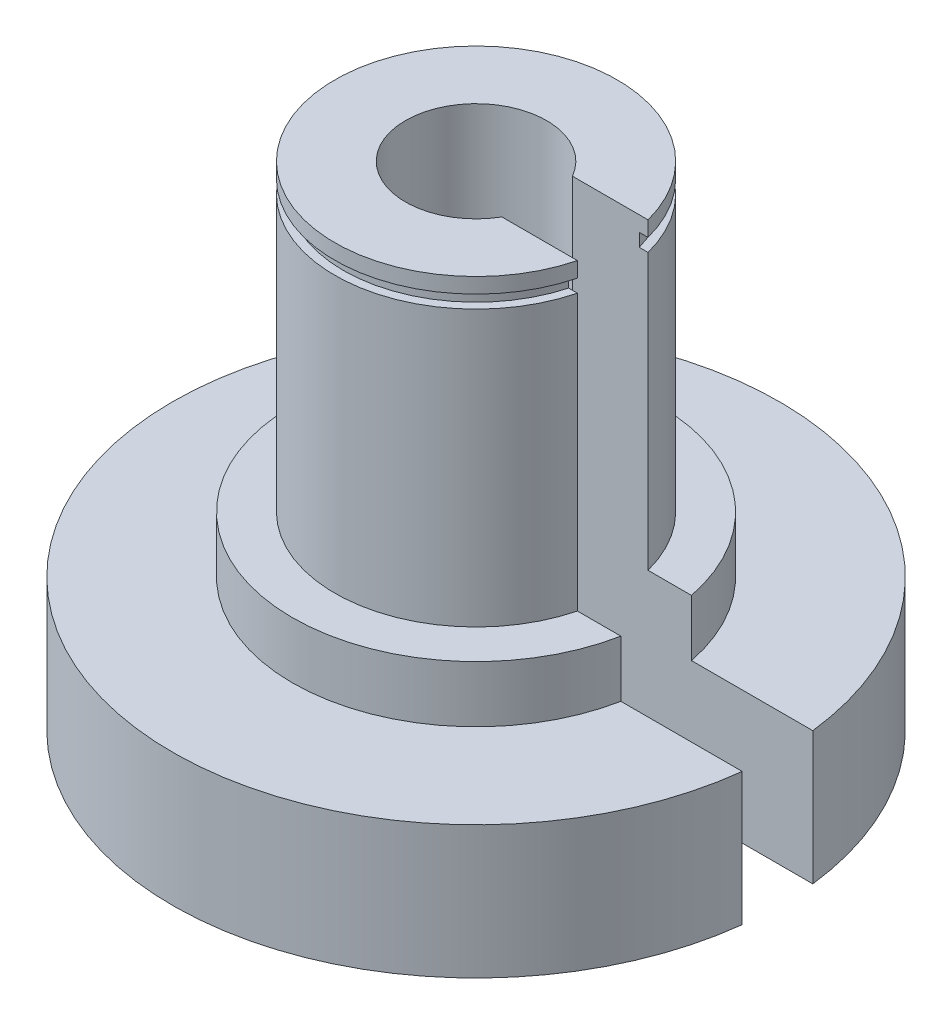
ISO-10303-21;
HEADER;
FILE_DESCRIPTION(('STEP AP214'),'2;1');
FILE_NAME('part.step','',(''),(''),'','','');
FILE_SCHEMA(('AUTOMOTIVE_DESIGN { 1 0 10303 214 1 1 1 1 }'));
ENDSEC;
DATA;
#1=APPLICATION_CONTEXT('core data for automotive mechanical design processes');
#2=APPLICATION_PROTOCOL_DEFINITION('international standard','automotive_design',2000,#1);
#3=PRODUCT_CONTEXT('',#1,'mechanical');
#4=PRODUCT('Part','Part','',(#3));
#5=PRODUCT_RELATED_PRODUCT_CATEGORY('part','',(#4));
#6=PRODUCT_DEFINITION_FORMATION('','',#4);
#7=PRODUCT_DEFINITION_CONTEXT('part definition',#1,'design');
#8=PRODUCT_DEFINITION('design','',#6,#7);
#9=PRODUCT_DEFINITION_SHAPE('','',#8);
#10=(LENGTH_UNIT() NAMED_UNIT(*) SI_UNIT(.MILLI.,.METRE.));
#11=(NAMED_UNIT(*) PLANE_ANGLE_UNIT() SI_UNIT($,.RADIAN.));
#12=(NAMED_UNIT(*) SI_UNIT($,.STERADIAN.) SOLID_ANGLE_UNIT());
#13=UNCERTAINTY_MEASURE_WITH_UNIT(LENGTH_MEASURE(1.E-05),#10,'distance_accuracy_value','');
#14=(GEOMETRIC_REPRESENTATION_CONTEXT(3) GLOBAL_UNCERTAINTY_ASSIGNED_CONTEXT((#13)) GLOBAL_UNIT_ASSIGNED_CONTEXT((#10,
#11,#12)) REPRESENTATION_CONTEXT('',''));
#15=CARTESIAN_POINT('',(0.,0.,0.));
#16=DIRECTION('',(0.,0.,1.));
#17=DIRECTION('',(1.,0.,0.));
#18=AXIS2_PLACEMENT_3D('',#15,#16,#17);
#19=CARTESIAN_POINT('',(0.,57.658,0.));
#20=DIRECTION('',(0.,-1.,0.));
#21=DIRECTION('',(0.,0.,-1.));
#22=AXIS2_PLACEMENT_3D('',#19,#20,#21);
#23=CYLINDRICAL_SURFACE('',#22,27.305);
#24=DIRECTION('',(0.,-1.,0.));
#25=VECTOR('',#24,1.);
#26=CARTESIAN_POINT('',(27.1197787601595,57.658,3.175));
#27=LINE('',#26,#25);
#28=CARTESIAN_POINT('',(27.1197787601595,0.,3.175));
#29=VERTEX_POINT('',#28);
#30=CARTESIAN_POINT('',(27.1197787601595,11.938,3.175));
#31=VERTEX_POINT('',#30);
#32=EDGE_CURVE('E179',#29,#31,#27,.F.);
#33=ORIENTED_EDGE('',*,*,#32,.T.);
#34=CARTESIAN_POINT('',(0.,11.938,0.));
#35=DIRECTION('',(0.,1.,0.));
#36=DIRECTION('',(0.,0.,1.));
#37=AXIS2_PLACEMENT_3D('',#34,#35,#36);
#38=CIRCLE('',#37,27.305);
#39=CARTESIAN_POINT('',(27.1197787601595,11.938,-3.175));
#40=VERTEX_POINT('',#39);
#41=EDGE_CURVE('E204',#40,#31,#38,.T.);
#42=ORIENTED_EDGE('',*,*,#41,.F.);
#43=DIRECTION('',(0.,-1.,0.));
#44=VECTOR('',#43,1.);
#45=CARTESIAN_POINT('',(27.1197787601595,57.658,-3.175));
#46=LINE('',#45,#44);
#47=CARTESIAN_POINT('',(27.1197787601595,0.,-3.175));
#48=VERTEX_POINT('',#47);
#49=EDGE_CURVE('E49',#40,#48,#46,.T.);
#50=ORIENTED_EDGE('',*,*,#49,.T.);
#51=CARTESIAN_POINT('',(0.,0.,0.));
#52=DIRECTION('',(0.,1.,0.));
#53=DIRECTION('',(0.,0.,1.));
#54=AXIS2_PLACEMENT_3D('',#51,#52,#53);
#55=CIRCLE('',#54,27.305);
#56=EDGE_CURVE('E186',#48,#29,#55,.T.);
#57=ORIENTED_EDGE('',*,*,#56,.T.);
#58=EDGE_LOOP('',(#33,#42,#50,#57));
#59=FACE_BOUND('',#58,.T.);
#60=ADVANCED_FACE('F35',(#59),#23,.T.);
#61=CARTESIAN_POINT('',(0.,13.208,0.));
#62=DIRECTION('',(0.,1.,0.));
#63=DIRECTION('',(0.,0.,1.));
#64=AXIS2_PLACEMENT_3D('',#61,#62,#63);
#65=CYLINDRICAL_SURFACE('',#64,6.35);
#66=CARTESIAN_POINT('',(0.,44.323,0.));
#67=DIRECTION('',(0.,1.,0.));
#68=DIRECTION('',(0.,0.,1.));
#69=AXIS2_PLACEMENT_3D('',#66,#67,#68);
#70=CIRCLE('',#69,6.35);
#71=CARTESIAN_POINT('',(5.49926131403119,44.323,3.175));
#72=VERTEX_POINT('',#71);
#73=CARTESIAN_POINT('',(5.49926131403118,44.323,-3.175));
#74=VERTEX_POINT('',#73);
#75=EDGE_CURVE('E152',#72,#74,#70,.F.);
#76=ORIENTED_EDGE('',*,*,#75,.F.);
#77=DIRECTION('',(0.,1.,0.));
#78=VECTOR('',#77,1.);
#79=CARTESIAN_POINT('',(5.49926131403119,13.208,3.175));
#80=LINE('',#79,#78);
#81=CARTESIAN_POINT('',(5.49926131403119,13.208,3.175));
#82=VERTEX_POINT('',#81);
#83=EDGE_CURVE('E221',#72,#82,#80,.F.);
#84=ORIENTED_EDGE('',*,*,#83,.T.);
#85=CARTESIAN_POINT('',(0.,13.208,0.));
#86=DIRECTION('',(0.,1.,0.));
#87=DIRECTION('',(0.,0.,1.));
#88=AXIS2_PLACEMENT_3D('',#85,#86,#87);
#89=CIRCLE('',#88,6.35);
#90=CARTESIAN_POINT('',(5.49926131403118,13.208,-3.175));
#91=VERTEX_POINT('',#90);
#92=EDGE_CURVE('E154',#91,#82,#89,.T.);
#93=ORIENTED_EDGE('',*,*,#92,.F.);
#94=DIRECTION('',(0.,1.,0.));
#95=VECTOR('',#94,1.);
#96=CARTESIAN_POINT('',(5.49926131403118,13.208,-3.175));
#97=LINE('',#96,#95);
#98=EDGE_CURVE('E137',#91,#74,#97,.T.);
#99=ORIENTED_EDGE('',*,*,#98,.T.);
#100=EDGE_LOOP('',(#76,#84,#93,#99));
#101=FACE_BOUND('',#100,.T.);
#102=ADVANCED_FACE('F150',(#101),#65,.F.);
#103=CARTESIAN_POINT('',(0.,13.208,0.));
#104=DIRECTION('',(0.,1.,0.));
#105=DIRECTION('',(0.,0.,1.));
#106=AXIS2_PLACEMENT_3D('',#103,#104,#105);
#107=CYLINDRICAL_SURFACE('',#106,12.7);
#108=DIRECTION('',(0.,1.,0.));
#109=VECTOR('',#108,1.);
#110=CARTESIAN_POINT('',(12.2967221242085,13.208,3.175));
#111=LINE('',#110,#109);
#112=CARTESIAN_POINT('',(12.2967221242085,44.323,3.175));
#113=VERTEX_POINT('',#112);
#114=CARTESIAN_POINT('',(12.2967221242085,42.9514,3.175));
#115=VERTEX_POINT('',#114);
#116=EDGE_CURVE('E226',#113,#115,#111,.F.);
#117=ORIENTED_EDGE('',*,*,#116,.F.);
#118=CARTESIAN_POINT('',(0.,44.323,0.));
#119=DIRECTION('',(0.,1.,0.));
#120=DIRECTION('',(0.,0.,1.));
#121=AXIS2_PLACEMENT_3D('',#118,#119,#120);
#122=CIRCLE('',#121,12.7);
#123=CARTESIAN_POINT('',(12.2967221242085,44.323,-3.175));
#124=VERTEX_POINT('',#123);
#125=EDGE_CURVE('E160',#113,#124,#122,.F.);
#126=ORIENTED_EDGE('',*,*,#125,.T.);
#127=DIRECTION('',(0.,1.,0.));
#128=VECTOR('',#127,1.);
#129=CARTESIAN_POINT('',(12.2967221242085,13.208,-3.175));
#130=LINE('',#129,#128);
#131=CARTESIAN_POINT('',(12.2967221242085,42.9514,-3.175));
#132=VERTEX_POINT('',#131);
#133=EDGE_CURVE('E140',#132,#124,#130,.T.);
#134=ORIENTED_EDGE('',*,*,#133,.F.);
#135=CARTESIAN_POINT('',(0.,42.9514,0.));
#136=DIRECTION('',(0.,1.,0.));
#137=DIRECTION('',(0.,0.,1.));
#138=AXIS2_PLACEMENT_3D('',#135,#136,#137);
#139=CIRCLE('',#138,12.7);
#140=EDGE_CURVE('E175',#115,#132,#139,.F.);
#141=ORIENTED_EDGE('',*,*,#140,.F.);
#142=EDGE_LOOP('',(#117,#126,#134,#141));
#143=FACE_BOUND('',#142,.T.);
#144=ADVANCED_FACE('F277',(#143),#107,.T.);
#145=DIRECTION('',(0.,1.,0.));
#146=VECTOR('',#145,1.);
#147=CARTESIAN_POINT('',(12.2967221242085,13.208,3.175));
#148=LINE('',#147,#146);
#149=CARTESIAN_POINT('',(12.2967221242085,41.783,3.175));
#150=VERTEX_POINT('',#149);
#151=CARTESIAN_POINT('',(12.2967221242085,17.018,3.175));
#152=VERTEX_POINT('',#151);
#153=EDGE_CURVE('E236',#150,#152,#148,.F.);
#154=ORIENTED_EDGE('',*,*,#153,.F.);
#155=CARTESIAN_POINT('',(0.,41.783,0.));
#156=DIRECTION('',(0.,1.,0.));
#157=DIRECTION('',(0.,0.,1.));
#158=AXIS2_PLACEMENT_3D('',#155,#156,#157);
#159=CIRCLE('',#158,12.7);
#160=CARTESIAN_POINT('',(12.2967221242085,41.783,-3.175));
#161=VERTEX_POINT('',#160);
#162=EDGE_CURVE('E171',#150,#161,#159,.F.);
#163=ORIENTED_EDGE('',*,*,#162,.T.);
#164=DIRECTION('',(0.,1.,0.));
#165=VECTOR('',#164,1.);
#166=CARTESIAN_POINT('',(12.2967221242085,13.208,-3.175));
#167=LINE('',#166,#165);
#168=CARTESIAN_POINT('',(12.2967221242085,17.018,-3.175));
#169=VERTEX_POINT('',#168);
#170=EDGE_CURVE('E251',#169,#161,#167,.T.);
#171=ORIENTED_EDGE('',*,*,#170,.F.);
#172=CARTESIAN_POINT('',(0.,17.018,0.));
#173=DIRECTION('',(0.,1.,0.));
#174=DIRECTION('',(0.,0.,1.));
#175=AXIS2_PLACEMENT_3D('',#172,#173,#174);
#176=CIRCLE('',#175,12.7);
#177=EDGE_CURVE('E197',#152,#169,#176,.F.);
#178=ORIENTED_EDGE('',*,*,#177,.F.);
#179=EDGE_LOOP('',(#154,#163,#171,#178));
#180=FACE_BOUND('',#179,.T.);
#181=ADVANCED_FACE('F260',(#180),#107,.T.);
#182=CARTESIAN_POINT('',(0.,57.658,0.));
#183=DIRECTION('',(0.,-1.,0.));
#184=DIRECTION('',(0.,0.,-1.));
#185=AXIS2_PLACEMENT_3D('',#182,#183,#184);
#186=CYLINDRICAL_SURFACE('',#185,4.5466);
#187=CARTESIAN_POINT('',(0.,13.208,0.));
#188=DIRECTION('',(0.,1.,0.));
#189=DIRECTION('',(0.,0.,1.));
#190=AXIS2_PLACEMENT_3D('',#187,#188,#189);
#191=CIRCLE('',#190,4.5466);
#192=CARTESIAN_POINT('',(3.25437345121914,13.208,-3.175));
#193=VERTEX_POINT('',#192);
#194=CARTESIAN_POINT('',(3.25437345121914,13.208,3.175));
#195=VERTEX_POINT('',#194);
#196=EDGE_CURVE('E182',#193,#195,#191,.T.);
#197=ORIENTED_EDGE('',*,*,#196,.T.);
#198=DIRECTION('',(0.,-1.,0.));
#199=VECTOR('',#198,1.);
#200=CARTESIAN_POINT('',(3.25437345121914,57.658,3.175));
#201=LINE('',#200,#199);
#202=CARTESIAN_POINT('',(3.25437345121914,0.,3.175));
#203=VERTEX_POINT('',#202);
#204=EDGE_CURVE('E177',#203,#195,#201,.F.);
#205=ORIENTED_EDGE('',*,*,#204,.F.);
#206=CARTESIAN_POINT('',(0.,0.,0.));
#207=DIRECTION('',(0.,1.,0.));
#208=DIRECTION('',(0.,0.,1.));
#209=AXIS2_PLACEMENT_3D('',#206,#207,#208);
#210=CIRCLE('',#209,4.5466);
#211=CARTESIAN_POINT('',(3.25437345121914,0.,-3.175));
#212=VERTEX_POINT('',#211);
#213=EDGE_CURVE('E183',#212,#203,#210,.T.);
#214=ORIENTED_EDGE('',*,*,#213,.F.);
#215=DIRECTION('',(0.,-1.,0.));
#216=VECTOR('',#215,1.);
#217=CARTESIAN_POINT('',(3.25437345121914,57.658,-3.175));
#218=LINE('',#217,#216);
#219=EDGE_CURVE('E173',#193,#212,#218,.T.);
#220=ORIENTED_EDGE('',*,*,#219,.F.);
#221=EDGE_LOOP('',(#197,#205,#214,#220));
#222=FACE_BOUND('',#221,.T.);
#223=ADVANCED_FACE('F288',(#222),#186,.F.);
#224=CARTESIAN_POINT('',(0.,0.,0.));
#225=DIRECTION('',(0.,1.,0.));
#226=DIRECTION('',(0.,0.,1.));
#227=AXIS2_PLACEMENT_3D('',#224,#225,#226);
#228=PLANE('',#227);
#229=ORIENTED_EDGE('',*,*,#213,.T.);
#230=DIRECTION('',(1.,0.,0.));
#231=VECTOR('',#230,1.);
#232=CARTESIAN_POINT('',(0.,0.,3.175));
#233=LINE('',#232,#231);
#234=EDGE_CURVE('E194',#203,#29,#233,.T.);
#235=ORIENTED_EDGE('',*,*,#234,.T.);
#236=ORIENTED_EDGE('',*,*,#56,.F.);
#237=DIRECTION('',(-1.,0.,0.));
#238=VECTOR('',#237,1.);
#239=CARTESIAN_POINT('',(0.,0.,-3.175));
#240=LINE('',#239,#238);
#241=EDGE_CURVE('E189',#48,#212,#240,.T.);
#242=ORIENTED_EDGE('',*,*,#241,.T.);
#243=EDGE_LOOP('',(#229,#235,#236,#242));
#244=FACE_BOUND('',#243,.T.);
#245=ADVANCED_FACE('F286',(#244),#228,.F.);
#246=CARTESIAN_POINT('',(0.,13.208,0.));
#247=DIRECTION('',(0.,1.,0.));
#248=DIRECTION('',(0.,0.,1.));
#249=AXIS2_PLACEMENT_3D('',#246,#247,#248);
#250=PLANE('',#249);
#251=DIRECTION('',(1.,0.,0.));
#252=VECTOR('',#251,1.);
#253=CARTESIAN_POINT('',(0.,13.208,3.175));
#254=LINE('',#253,#252);
#255=EDGE_CURVE('E222',#195,#82,#254,.T.);
#256=ORIENTED_EDGE('',*,*,#255,.F.);
#257=ORIENTED_EDGE('',*,*,#196,.F.);
#258=DIRECTION('',(-1.,0.,0.));
#259=VECTOR('',#258,1.);
#260=CARTESIAN_POINT('',(0.,13.208,-3.175));
#261=LINE('',#260,#259);
#262=EDGE_CURVE('E155',#91,#193,#261,.T.);
#263=ORIENTED_EDGE('',*,*,#262,.F.);
#264=ORIENTED_EDGE('',*,*,#92,.T.);
#265=EDGE_LOOP('',(#256,#257,#263,#264));
#266=FACE_BOUND('',#265,.T.);
#267=ADVANCED_FACE('F280',(#266),#250,.T.);
#268=CARTESIAN_POINT('',(2.49980958537012,6.35,3.175));
#269=DIRECTION('',(0.,0.,1.));
#270=DIRECTION('',(1.,0.,0.));
#271=AXIS2_PLACEMENT_3D('',#268,#269,#270);
#272=PLANE('',#271);
#273=ORIENTED_EDGE('',*,*,#234,.F.);
#274=ORIENTED_EDGE('',*,*,#204,.T.);
#275=ORIENTED_EDGE('',*,*,#255,.T.);
#276=ORIENTED_EDGE('',*,*,#83,.F.);
#277=DIRECTION('',(-1.,0.,0.));
#278=VECTOR('',#277,1.);
#279=CARTESIAN_POINT('',(2.49980958537012,44.323,3.175));
#280=LINE('',#279,#278);
#281=EDGE_CURVE('E145',#113,#72,#280,.T.);
#282=ORIENTED_EDGE('',*,*,#281,.F.);
#283=ORIENTED_EDGE('',*,*,#116,.T.);
#284=DIRECTION('',(1.,0.,0.));
#285=VECTOR('',#284,1.);
#286=CARTESIAN_POINT('',(0.,42.9514,3.175));
#287=LINE('',#286,#285);
#288=CARTESIAN_POINT('',(11.5080501823723,42.9514,3.175));
#289=VERTEX_POINT('',#288);
#290=EDGE_CURVE('E228',#289,#115,#287,.T.);
#291=ORIENTED_EDGE('',*,*,#290,.F.);
#292=DIRECTION('',(0.,-1.,0.));
#293=VECTOR('',#292,1.);
#294=CARTESIAN_POINT('',(11.5080501823723,42.9514,3.175));
#295=LINE('',#294,#293);
#296=CARTESIAN_POINT('',(11.5080501823723,41.783,3.175));
#297=VERTEX_POINT('',#296);
#298=EDGE_CURVE('E231',#297,#289,#295,.F.);
#299=ORIENTED_EDGE('',*,*,#298,.F.);
#300=DIRECTION('',(1.,0.,0.));
#301=VECTOR('',#300,1.);
#302=CARTESIAN_POINT('',(0.,41.783,3.175));
#303=LINE('',#302,#301);
#304=EDGE_CURVE('E234',#297,#150,#303,.T.);
#305=ORIENTED_EDGE('',*,*,#304,.T.);
#306=ORIENTED_EDGE('',*,*,#153,.T.);
#307=DIRECTION('',(1.,0.,0.));
#308=VECTOR('',#307,1.);
#309=CARTESIAN_POINT('',(0.,17.018,3.175));
#310=LINE('',#309,#308);
#311=CARTESIAN_POINT('',(16.2018355441598,17.018,3.175));
#312=VERTEX_POINT('',#311);
#313=EDGE_CURVE('E238',#152,#312,#310,.T.);
#314=ORIENTED_EDGE('',*,*,#313,.T.);
#315=DIRECTION('',(0.,-1.,0.));
#316=VECTOR('',#315,1.);
#317=CARTESIAN_POINT('',(16.2018355441598,17.018,3.175));
#318=LINE('',#317,#316);
#319=CARTESIAN_POINT('',(16.2018355441598,11.938,3.175));
#320=VERTEX_POINT('',#319);
#321=EDGE_CURVE('E56',#320,#312,#318,.F.);
#322=ORIENTED_EDGE('',*,*,#321,.F.);
#323=DIRECTION('',(1.,0.,0.));
#324=VECTOR('',#323,1.);
#325=CARTESIAN_POINT('',(0.,11.938,3.175));
#326=LINE('',#325,#324);
#327=EDGE_CURVE('E12',#320,#31,#326,.T.);
#328=ORIENTED_EDGE('',*,*,#327,.T.);
#329=ORIENTED_EDGE('',*,*,#32,.F.);
#330=EDGE_LOOP('',(#273,#274,#275,#276,#282,#283,#291,#299,#305,#306,#314,#322,#328,#329));
#331=FACE_BOUND('',#330,.T.);
#332=ADVANCED_FACE('F264',(#331),#272,.F.);
#333=CARTESIAN_POINT('',(2.49980958537012,6.35,-3.175));
#334=DIRECTION('',(0.,0.,-1.));
#335=DIRECTION('',(-1.,0.,0.));
#336=AXIS2_PLACEMENT_3D('',#333,#334,#335);
#337=PLANE('',#336);
#338=ORIENTED_EDGE('',*,*,#49,.F.);
#339=DIRECTION('',(-1.,0.,0.));
#340=VECTOR('',#339,1.);
#341=CARTESIAN_POINT('',(0.,11.938,-3.175));
#342=LINE('',#341,#340);
#343=CARTESIAN_POINT('',(16.2018355441598,11.938,-3.175));
#344=VERTEX_POINT('',#343);
#345=EDGE_CURVE('E42',#40,#344,#342,.T.);
#346=ORIENTED_EDGE('',*,*,#345,.T.);
#347=DIRECTION('',(0.,-1.,0.));
#348=VECTOR('',#347,1.);
#349=CARTESIAN_POINT('',(16.2018355441598,17.018,-3.175));
#350=LINE('',#349,#348);
#351=CARTESIAN_POINT('',(16.2018355441598,17.018,-3.175));
#352=VERTEX_POINT('',#351);
#353=EDGE_CURVE('E208',#352,#344,#350,.T.);
#354=ORIENTED_EDGE('',*,*,#353,.F.);
#355=DIRECTION('',(-1.,0.,0.));
#356=VECTOR('',#355,1.);
#357=CARTESIAN_POINT('',(0.,17.018,-3.175));
#358=LINE('',#357,#356);
#359=EDGE_CURVE('E218',#352,#169,#358,.T.);
#360=ORIENTED_EDGE('',*,*,#359,.T.);
#361=ORIENTED_EDGE('',*,*,#170,.T.);
#362=DIRECTION('',(-1.,0.,0.));
#363=VECTOR('',#362,1.);
#364=CARTESIAN_POINT('',(0.,41.783,-3.175));
#365=LINE('',#364,#363);
#366=CARTESIAN_POINT('',(11.5080501823723,41.783,-3.175));
#367=VERTEX_POINT('',#366);
#368=EDGE_CURVE('E249',#161,#367,#365,.T.);
#369=ORIENTED_EDGE('',*,*,#368,.T.);
#370=DIRECTION('',(0.,-1.,0.));
#371=VECTOR('',#370,1.);
#372=CARTESIAN_POINT('',(11.5080501823723,42.9514,-3.175));
#373=LINE('',#372,#371);
#374=CARTESIAN_POINT('',(11.5080501823723,42.9514,-3.175));
#375=VERTEX_POINT('',#374);
#376=EDGE_CURVE('E246',#375,#367,#373,.T.);
#377=ORIENTED_EDGE('',*,*,#376,.F.);
#378=DIRECTION('',(-1.,0.,0.));
#379=VECTOR('',#378,1.);
#380=CARTESIAN_POINT('',(0.,42.9514,-3.175));
#381=LINE('',#380,#379);
#382=EDGE_CURVE('E243',#132,#375,#381,.T.);
#383=ORIENTED_EDGE('',*,*,#382,.F.);
#384=ORIENTED_EDGE('',*,*,#133,.T.);
#385=DIRECTION('',(1.,0.,0.));
#386=VECTOR('',#385,1.);
#387=CARTESIAN_POINT('',(2.49980958537012,44.323,-3.175));
#388=LINE('',#387,#386);
#389=EDGE_CURVE('E133',#74,#124,#388,.T.);
#390=ORIENTED_EDGE('',*,*,#389,.F.);
#391=ORIENTED_EDGE('',*,*,#98,.F.);
#392=ORIENTED_EDGE('',*,*,#262,.T.);
#393=ORIENTED_EDGE('',*,*,#219,.T.);
#394=ORIENTED_EDGE('',*,*,#241,.F.);
#395=EDGE_LOOP('',(#338,#346,#354,#360,#361,#369,#377,#383,#384,#390,#391,#392,#393,#394));
#396=FACE_BOUND('',#395,.T.);
#397=ADVANCED_FACE('F135',(#396),#337,.F.);
#398=CARTESIAN_POINT('',(0.,42.9514,0.));
#399=DIRECTION('',(0.,1.,0.));
#400=DIRECTION('',(0.,0.,1.));
#401=AXIS2_PLACEMENT_3D('',#398,#399,#400);
#402=PLANE('',#401);
#403=CARTESIAN_POINT('',(0.,42.9514,0.));
#404=DIRECTION('',(0.,1.,0.));
#405=DIRECTION('',(0.,0.,1.));
#406=AXIS2_PLACEMENT_3D('',#403,#404,#405);
#407=CIRCLE('',#406,11.938);
#408=EDGE_CURVE('E163',#375,#289,#407,.T.);
#409=ORIENTED_EDGE('',*,*,#408,.T.);
#410=ORIENTED_EDGE('',*,*,#290,.T.);
#411=ORIENTED_EDGE('',*,*,#140,.T.);
#412=ORIENTED_EDGE('',*,*,#382,.T.);
#413=EDGE_LOOP('',(#409,#410,#411,#412));
#414=FACE_BOUND('',#413,.T.);
#415=ADVANCED_FACE('F273',(#414),#402,.F.);
#416=CARTESIAN_POINT('',(0.,41.783,0.));
#417=DIRECTION('',(0.,1.,0.));
#418=DIRECTION('',(0.,0.,1.));
#419=AXIS2_PLACEMENT_3D('',#416,#417,#418);
#420=PLANE('',#419);
#421=ORIENTED_EDGE('',*,*,#304,.F.);
#422=CARTESIAN_POINT('',(0.,41.783,0.));
#423=DIRECTION('',(0.,1.,0.));
#424=DIRECTION('',(0.,0.,1.));
#425=AXIS2_PLACEMENT_3D('',#422,#423,#424);
#426=CIRCLE('',#425,11.938);
#427=EDGE_CURVE('E159',#367,#297,#426,.T.);
#428=ORIENTED_EDGE('',*,*,#427,.F.);
#429=ORIENTED_EDGE('',*,*,#368,.F.);
#430=ORIENTED_EDGE('',*,*,#162,.F.);
#431=EDGE_LOOP('',(#421,#428,#429,#430));
#432=FACE_BOUND('',#431,.T.);
#433=ADVANCED_FACE('F267',(#432),#420,.T.);
#434=CARTESIAN_POINT('',(0.,42.9514,0.));
#435=DIRECTION('',(0.,-1.,0.));
#436=DIRECTION('',(0.,0.,-1.));
#437=AXIS2_PLACEMENT_3D('',#434,#435,#436);
#438=CYLINDRICAL_SURFACE('',#437,11.938);
#439=ORIENTED_EDGE('',*,*,#427,.T.);
#440=ORIENTED_EDGE('',*,*,#298,.T.);
#441=ORIENTED_EDGE('',*,*,#408,.F.);
#442=ORIENTED_EDGE('',*,*,#376,.T.);
#443=EDGE_LOOP('',(#439,#440,#441,#442));
#444=FACE_BOUND('',#443,.T.);
#445=ADVANCED_FACE('F271',(#444),#438,.T.);
#446=CARTESIAN_POINT('',(0.,44.323,0.));
#447=DIRECTION('',(0.,1.,0.));
#448=DIRECTION('',(0.,0.,1.));
#449=AXIS2_PLACEMENT_3D('',#446,#447,#448);
#450=PLANE('',#449);
#451=ORIENTED_EDGE('',*,*,#281,.T.);
#452=ORIENTED_EDGE('',*,*,#75,.T.);
#453=ORIENTED_EDGE('',*,*,#389,.T.);
#454=ORIENTED_EDGE('',*,*,#125,.F.);
#455=EDGE_LOOP('',(#451,#452,#453,#454));
#456=FACE_BOUND('',#455,.T.);
#457=ADVANCED_FACE('F158',(#456),#450,.T.);
#458=CARTESIAN_POINT('',(0.,17.018,0.));
#459=DIRECTION('',(0.,1.,0.));
#460=DIRECTION('',(0.,0.,1.));
#461=AXIS2_PLACEMENT_3D('',#458,#459,#460);
#462=PLANE('',#461);
#463=ORIENTED_EDGE('',*,*,#313,.F.);
#464=ORIENTED_EDGE('',*,*,#177,.T.);
#465=ORIENTED_EDGE('',*,*,#359,.F.);
#466=CARTESIAN_POINT('',(0.,17.018,0.));
#467=DIRECTION('',(0.,1.,0.));
#468=DIRECTION('',(0.,0.,1.));
#469=AXIS2_PLACEMENT_3D('',#466,#467,#468);
#470=CIRCLE('',#469,16.51);
#471=EDGE_CURVE('E165',#352,#312,#470,.T.);
#472=ORIENTED_EDGE('',*,*,#471,.T.);
#473=EDGE_LOOP('',(#463,#464,#465,#472));
#474=FACE_BOUND('',#473,.T.);
#475=ADVANCED_FACE('F263',(#474),#462,.T.);
#476=CARTESIAN_POINT('',(0.,17.018,0.));
#477=DIRECTION('',(0.,-1.,0.));
#478=DIRECTION('',(0.,0.,-1.));
#479=AXIS2_PLACEMENT_3D('',#476,#477,#478);
#480=CYLINDRICAL_SURFACE('',#479,16.51);
#481=CARTESIAN_POINT('',(0.,11.938,0.));
#482=DIRECTION('',(0.,1.,0.));
#483=DIRECTION('',(0.,0.,1.));
#484=AXIS2_PLACEMENT_3D('',#481,#482,#483);
#485=CIRCLE('',#484,16.51);
#486=EDGE_CURVE('E206',#344,#320,#485,.T.);
#487=ORIENTED_EDGE('',*,*,#486,.T.);
#488=ORIENTED_EDGE('',*,*,#321,.T.);
#489=ORIENTED_EDGE('',*,*,#471,.F.);
#490=ORIENTED_EDGE('',*,*,#353,.T.);
#491=EDGE_LOOP('',(#487,#488,#489,#490));
#492=FACE_BOUND('',#491,.T.);
#493=ADVANCED_FACE('F216',(#492),#480,.T.);
#494=CARTESIAN_POINT('',(0.,11.938,0.));
#495=DIRECTION('',(0.,1.,0.));
#496=DIRECTION('',(0.,0.,1.));
#497=AXIS2_PLACEMENT_3D('',#494,#495,#496);
#498=PLANE('',#497);
#499=ORIENTED_EDGE('',*,*,#327,.F.);
#500=ORIENTED_EDGE('',*,*,#486,.F.);
#501=ORIENTED_EDGE('',*,*,#345,.F.);
#502=ORIENTED_EDGE('',*,*,#41,.T.);
#503=EDGE_LOOP('',(#499,#500,#501,#502));
#504=FACE_BOUND('',#503,.T.);
#505=ADVANCED_FACE('F220',(#504),#498,.T.);
#506=CLOSED_SHELL('',(#60,#102,#144,#181,#223,#245,#267,#332,#397,#415,#433,#445,#457,#475,#493,#505));
#507=MANIFOLD_SOLID_BREP('B2',#506);
#508=ADVANCED_BREP_SHAPE_REPRESENTATION('',(#18,#507),#14);
#509=SHAPE_DEFINITION_REPRESENTATION(#9,#508);
ENDSEC;
END-ISO-10303-21;
